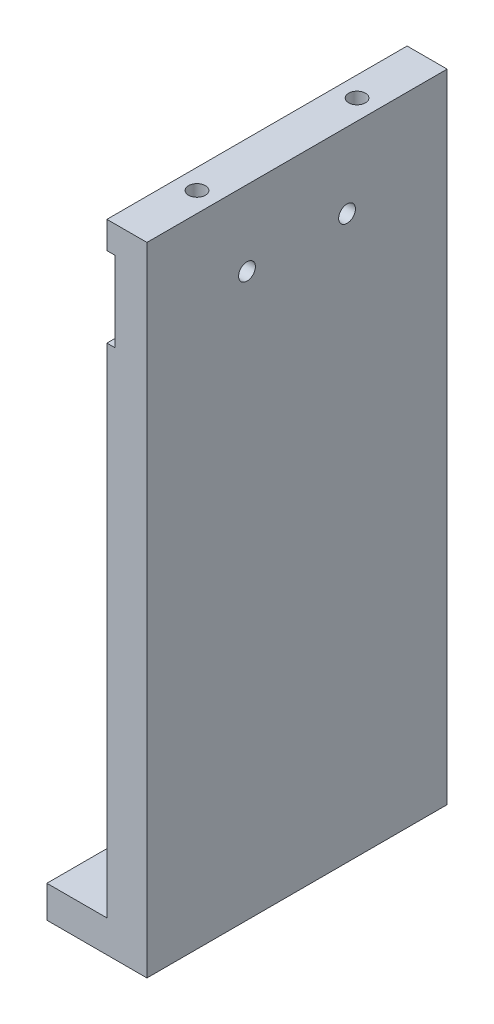
ISO-10303-21;
HEADER;
FILE_DESCRIPTION(('STEP AP214'),'2;1');
FILE_NAME('part.step','',(''),(''),'','','');
FILE_SCHEMA(('AUTOMOTIVE_DESIGN { 1 0 10303 214 1 1 1 1 }'));
ENDSEC;
DATA;
#1=APPLICATION_CONTEXT('core data for automotive mechanical design processes');
#2=APPLICATION_PROTOCOL_DEFINITION('international standard','automotive_design',2000,#1);
#3=PRODUCT_CONTEXT('',#1,'mechanical');
#4=PRODUCT('Part','Part','',(#3));
#5=PRODUCT_RELATED_PRODUCT_CATEGORY('part','',(#4));
#6=PRODUCT_DEFINITION_FORMATION('','',#4);
#7=PRODUCT_DEFINITION_CONTEXT('part definition',#1,'design');
#8=PRODUCT_DEFINITION('design','',#6,#7);
#9=PRODUCT_DEFINITION_SHAPE('','',#8);
#10=(LENGTH_UNIT() NAMED_UNIT(*) SI_UNIT(.MILLI.,.METRE.));
#11=(NAMED_UNIT(*) PLANE_ANGLE_UNIT() SI_UNIT($,.RADIAN.));
#12=(NAMED_UNIT(*) SI_UNIT($,.STERADIAN.) SOLID_ANGLE_UNIT());
#13=UNCERTAINTY_MEASURE_WITH_UNIT(LENGTH_MEASURE(1.E-05),#10,'distance_accuracy_value','');
#14=(GEOMETRIC_REPRESENTATION_CONTEXT(3) GLOBAL_UNCERTAINTY_ASSIGNED_CONTEXT((#13)) GLOBAL_UNIT_ASSIGNED_CONTEXT((#10,
#11,#12)) REPRESENTATION_CONTEXT('',''));
#15=CARTESIAN_POINT('',(0.,0.,0.));
#16=DIRECTION('',(0.,0.,1.));
#17=DIRECTION('',(1.,0.,0.));
#18=AXIS2_PLACEMENT_3D('',#15,#16,#17);
#19=CARTESIAN_POINT('',(0.,0.,75.));
#20=DIRECTION('',(1.,0.,0.));
#21=DIRECTION('',(0.,1.,0.));
#22=AXIS2_PLACEMENT_3D('',#19,#20,#21);
#23=PLANE('',#22);
#24=DIRECTION('',(0.,0.,-1.));
#25=VECTOR('',#24,1.);
#26=CARTESIAN_POINT('',(0.,8.,0.));
#27=LINE('',#26,#25);
#28=CARTESIAN_POINT('',(0.,8.,75.));
#29=VERTEX_POINT('',#28);
#30=CARTESIAN_POINT('',(0.,8.,0.));
#31=VERTEX_POINT('',#30);
#32=EDGE_CURVE('E53',#29,#31,#27,.T.);
#33=ORIENTED_EDGE('',*,*,#32,.F.);
#34=DIRECTION('',(0.,-1.,0.));
#35=VECTOR('',#34,1.);
#36=CARTESIAN_POINT('',(0.,0.,75.));
#37=LINE('',#36,#35);
#38=CARTESIAN_POINT('',(0.,132.38,75.));
#39=VERTEX_POINT('',#38);
#40=EDGE_CURVE('E210',#39,#29,#37,.T.);
#41=ORIENTED_EDGE('',*,*,#40,.F.);
#42=DIRECTION('',(0.,0.,1.));
#43=VECTOR('',#42,1.);
#44=CARTESIAN_POINT('',(0.,132.38,0.));
#45=LINE('',#44,#43);
#46=CARTESIAN_POINT('',(0.,132.38,0.));
#47=VERTEX_POINT('',#46);
#48=EDGE_CURVE('E172',#47,#39,#45,.T.);
#49=ORIENTED_EDGE('',*,*,#48,.F.);
#50=DIRECTION('',(0.,-1.,0.));
#51=VECTOR('',#50,1.);
#52=CARTESIAN_POINT('',(0.,0.,0.));
#53=LINE('',#52,#51);
#54=EDGE_CURVE('E58',#47,#31,#53,.T.);
#55=ORIENTED_EDGE('',*,*,#54,.T.);
#56=EDGE_LOOP('',(#33,#41,#49,#55));
#57=FACE_BOUND('',#56,.T.);
#58=ADVANCED_FACE('F39',(#57),#23,.F.);
#59=CARTESIAN_POINT('',(0.,159.15,0.));
#60=VERTEX_POINT('',#59);
#61=CARTESIAN_POINT('',(0.,152.38,0.));
#62=VERTEX_POINT('',#61);
#63=EDGE_CURVE('E132',#60,#62,#53,.T.);
#64=ORIENTED_EDGE('',*,*,#63,.T.);
#65=DIRECTION('',(0.,0.,-1.));
#66=VECTOR('',#65,1.);
#67=CARTESIAN_POINT('',(0.,152.38,0.));
#68=LINE('',#67,#66);
#69=CARTESIAN_POINT('',(0.,152.38,75.));
#70=VERTEX_POINT('',#69);
#71=EDGE_CURVE('E177',#70,#62,#68,.T.);
#72=ORIENTED_EDGE('',*,*,#71,.F.);
#73=CARTESIAN_POINT('',(0.,159.15,75.));
#74=VERTEX_POINT('',#73);
#75=EDGE_CURVE('E207',#74,#70,#37,.T.);
#76=ORIENTED_EDGE('',*,*,#75,.F.);
#77=DIRECTION('',(0.,0.,-1.));
#78=VECTOR('',#77,1.);
#79=CARTESIAN_POINT('',(0.,159.15,75.));
#80=LINE('',#79,#78);
#81=EDGE_CURVE('E216',#74,#60,#80,.T.);
#82=ORIENTED_EDGE('',*,*,#81,.T.);
#83=EDGE_LOOP('',(#64,#72,#76,#82));
#84=FACE_BOUND('',#83,.T.);
#85=ADVANCED_FACE('F236',(#84),#23,.F.);
#86=CARTESIAN_POINT('',(0.,0.,75.));
#87=DIRECTION('',(0.,1.,0.));
#88=DIRECTION('',(0.,0.,1.));
#89=AXIS2_PLACEMENT_3D('',#86,#87,#88);
#90=PLANE('',#89);
#91=CARTESIAN_POINT('',(-7.5,0.,57.5));
#92=DIRECTION('',(0.,1.,0.));
#93=DIRECTION('',(1.,0.,0.));
#94=AXIS2_PLACEMENT_3D('',#91,#92,#93);
#95=CIRCLE('',#94,3.25);
#96=CARTESIAN_POINT('',(-4.25,0.,57.5));
#97=VERTEX_POINT('',#96);
#98=EDGE_CURVE('E452',#97,#97,#95,.T.);
#99=ORIENTED_EDGE('',*,*,#98,.T.);
#100=EDGE_LOOP('',(#99));
#101=FACE_BOUND('',#100,.T.);
#102=CARTESIAN_POINT('',(-7.5,0.,17.5));
#103=DIRECTION('',(0.,1.,0.));
#104=DIRECTION('',(-1.,0.,0.));
#105=AXIS2_PLACEMENT_3D('',#102,#103,#104);
#106=CIRCLE('',#105,3.25);
#107=CARTESIAN_POINT('',(-10.75,0.,17.5));
#108=VERTEX_POINT('',#107);
#109=EDGE_CURVE('E147',#108,#108,#106,.T.);
#110=ORIENTED_EDGE('',*,*,#109,.T.);
#111=EDGE_LOOP('',(#110));
#112=FACE_BOUND('',#111,.T.);
#113=DIRECTION('',(1.,0.,0.));
#114=VECTOR('',#113,1.);
#115=CARTESIAN_POINT('',(0.,0.,0.));
#116=LINE('',#115,#114);
#117=CARTESIAN_POINT('',(-15.,0.,0.));
#118=VERTEX_POINT('',#117);
#119=CARTESIAN_POINT('',(10.,0.,0.));
#120=VERTEX_POINT('',#119);
#121=EDGE_CURVE('E121',#118,#120,#116,.T.);
#122=ORIENTED_EDGE('',*,*,#121,.T.);
#123=DIRECTION('',(0.,0.,-1.));
#124=VECTOR('',#123,1.);
#125=CARTESIAN_POINT('',(10.,0.,75.));
#126=LINE('',#125,#124);
#127=CARTESIAN_POINT('',(10.,0.,75.));
#128=VERTEX_POINT('',#127);
#129=EDGE_CURVE('E11',#128,#120,#126,.T.);
#130=ORIENTED_EDGE('',*,*,#129,.F.);
#131=DIRECTION('',(1.,0.,0.));
#132=VECTOR('',#131,1.);
#133=CARTESIAN_POINT('',(0.,0.,75.));
#134=LINE('',#133,#132);
#135=CARTESIAN_POINT('',(-15.,0.,75.));
#136=VERTEX_POINT('',#135);
#137=EDGE_CURVE('E137',#136,#128,#134,.T.);
#138=ORIENTED_EDGE('',*,*,#137,.F.);
#139=DIRECTION('',(0.,0.,1.));
#140=VECTOR('',#139,1.);
#141=CARTESIAN_POINT('',(-15.,0.,0.));
#142=LINE('',#141,#140);
#143=EDGE_CURVE('E135',#118,#136,#142,.T.);
#144=ORIENTED_EDGE('',*,*,#143,.F.);
#145=EDGE_LOOP('',(#122,#130,#138,#144));
#146=FACE_BOUND('',#145,.T.);
#147=ADVANCED_FACE('F136',(#101,#112,#146),#90,.F.);
#148=CARTESIAN_POINT('',(10.,0.,75.));
#149=DIRECTION('',(-1.,0.,0.));
#150=DIRECTION('',(0.,-1.,0.));
#151=AXIS2_PLACEMENT_3D('',#148,#149,#150);
#152=PLANE('',#151);
#153=CARTESIAN_POINT('',(9.99999999999997,140.3817,25.));
#154=DIRECTION('',(-1.,0.,0.));
#155=DIRECTION('',(0.,-1.,0.));
#156=AXIS2_PLACEMENT_3D('',#153,#154,#155);
#157=CIRCLE('',#156,2.09999999999999);
#158=CARTESIAN_POINT('',(9.99999999999997,138.2817,25.));
#159=VERTEX_POINT('',#158);
#160=EDGE_CURVE('E163',#159,#159,#157,.T.);
#161=ORIENTED_EDGE('',*,*,#160,.T.);
#162=EDGE_LOOP('',(#161));
#163=FACE_BOUND('',#162,.T.);
#164=CARTESIAN_POINT('',(9.99999999999997,140.3817,50.));
#165=DIRECTION('',(-1.,0.,0.));
#166=DIRECTION('',(0.,-1.,0.));
#167=AXIS2_PLACEMENT_3D('',#164,#165,#166);
#168=CIRCLE('',#167,2.09999999999999);
#169=CARTESIAN_POINT('',(9.99999999999997,138.2817,50.));
#170=VERTEX_POINT('',#169);
#171=EDGE_CURVE('E169',#170,#170,#168,.T.);
#172=ORIENTED_EDGE('',*,*,#171,.T.);
#173=EDGE_LOOP('',(#172));
#174=FACE_BOUND('',#173,.T.);
#175=DIRECTION('',(0.,1.,0.));
#176=VECTOR('',#175,1.);
#177=CARTESIAN_POINT('',(10.,0.,0.));
#178=LINE('',#177,#176);
#179=CARTESIAN_POINT('',(9.99999999999997,159.15,0.));
#180=VERTEX_POINT('',#179);
#181=EDGE_CURVE('E129',#120,#180,#178,.T.);
#182=ORIENTED_EDGE('',*,*,#181,.T.);
#183=DIRECTION('',(0.,0.,-1.));
#184=VECTOR('',#183,1.);
#185=CARTESIAN_POINT('',(9.99999999999997,159.15,75.));
#186=LINE('',#185,#184);
#187=CARTESIAN_POINT('',(9.99999999999997,159.15,75.));
#188=VERTEX_POINT('',#187);
#189=EDGE_CURVE('E46',#188,#180,#186,.T.);
#190=ORIENTED_EDGE('',*,*,#189,.F.);
#191=DIRECTION('',(0.,1.,0.));
#192=VECTOR('',#191,1.);
#193=CARTESIAN_POINT('',(10.,0.,75.));
#194=LINE('',#193,#192);
#195=EDGE_CURVE('E212',#128,#188,#194,.T.);
#196=ORIENTED_EDGE('',*,*,#195,.F.);
#197=ORIENTED_EDGE('',*,*,#129,.T.);
#198=EDGE_LOOP('',(#182,#190,#196,#197));
#199=FACE_BOUND('',#198,.T.);
#200=ADVANCED_FACE('F242',(#163,#174,#199),#152,.F.);
#201=CARTESIAN_POINT('',(0.,159.15,75.));
#202=DIRECTION('',(0.,-1.,0.));
#203=DIRECTION('',(0.,0.,-1.));
#204=AXIS2_PLACEMENT_3D('',#201,#202,#203);
#205=PLANE('',#204);
#206=CARTESIAN_POINT('',(4.99999999999922,159.15,57.4999999999991));
#207=DIRECTION('',(0.,1.,0.));
#208=DIRECTION('',(0.,0.,1.));
#209=AXIS2_PLACEMENT_3D('',#206,#207,#208);
#210=CIRCLE('',#209,2.09999999999999);
#211=CARTESIAN_POINT('',(4.99999999999922,159.15,59.599999999999));
#212=VERTEX_POINT('',#211);
#213=EDGE_CURVE('E189',#212,#212,#210,.T.);
#214=ORIENTED_EDGE('',*,*,#213,.F.);
#215=EDGE_LOOP('',(#214));
#216=FACE_BOUND('',#215,.T.);
#217=CARTESIAN_POINT('',(4.99999999999922,159.15,17.499999999999));
#218=DIRECTION('',(0.,1.,0.));
#219=DIRECTION('',(0.,0.,1.));
#220=AXIS2_PLACEMENT_3D('',#217,#218,#219);
#221=CIRCLE('',#220,2.09999999999999);
#222=CARTESIAN_POINT('',(4.99999999999922,159.15,19.599999999999));
#223=VERTEX_POINT('',#222);
#224=EDGE_CURVE('E201',#223,#223,#221,.T.);
#225=ORIENTED_EDGE('',*,*,#224,.F.);
#226=EDGE_LOOP('',(#225));
#227=FACE_BOUND('',#226,.T.);
#228=DIRECTION('',(-1.,0.,0.));
#229=VECTOR('',#228,1.);
#230=CARTESIAN_POINT('',(0.,159.15,0.));
#231=LINE('',#230,#229);
#232=EDGE_CURVE('E220',#180,#60,#231,.T.);
#233=ORIENTED_EDGE('',*,*,#232,.T.);
#234=ORIENTED_EDGE('',*,*,#81,.F.);
#235=DIRECTION('',(-1.,0.,0.));
#236=VECTOR('',#235,1.);
#237=CARTESIAN_POINT('',(0.,159.15,75.));
#238=LINE('',#237,#236);
#239=EDGE_CURVE('E214',#188,#74,#238,.T.);
#240=ORIENTED_EDGE('',*,*,#239,.F.);
#241=ORIENTED_EDGE('',*,*,#189,.T.);
#242=EDGE_LOOP('',(#233,#234,#240,#241));
#243=FACE_BOUND('',#242,.T.);
#244=ADVANCED_FACE('F227',(#216,#227,#243),#205,.F.);
#245=CARTESIAN_POINT('',(0.,0.,75.));
#246=DIRECTION('',(0.,0.,-1.));
#247=DIRECTION('',(-1.,0.,0.));
#248=AXIS2_PLACEMENT_3D('',#245,#246,#247);
#249=PLANE('',#248);
#250=ORIENTED_EDGE('',*,*,#75,.T.);
#251=DIRECTION('',(-1.,0.,0.));
#252=VECTOR('',#251,1.);
#253=CARTESIAN_POINT('',(1.99999999999997,152.38,75.));
#254=LINE('',#253,#252);
#255=CARTESIAN_POINT('',(1.99999999999997,152.38,75.));
#256=VERTEX_POINT('',#255);
#257=EDGE_CURVE('E190',#256,#70,#254,.T.);
#258=ORIENTED_EDGE('',*,*,#257,.F.);
#259=DIRECTION('',(0.,1.,0.));
#260=VECTOR('',#259,1.);
#261=CARTESIAN_POINT('',(1.99999999999997,152.38,75.));
#262=LINE('',#261,#260);
#263=CARTESIAN_POINT('',(1.99999999999998,132.38,75.));
#264=VERTEX_POINT('',#263);
#265=EDGE_CURVE('E180',#264,#256,#262,.T.);
#266=ORIENTED_EDGE('',*,*,#265,.F.);
#267=DIRECTION('',(-1.,0.,0.));
#268=VECTOR('',#267,1.);
#269=CARTESIAN_POINT('',(1.99999999999998,132.38,75.));
#270=LINE('',#269,#268);
#271=EDGE_CURVE('E192',#264,#39,#270,.T.);
#272=ORIENTED_EDGE('',*,*,#271,.T.);
#273=ORIENTED_EDGE('',*,*,#40,.T.);
#274=DIRECTION('',(1.,0.,0.));
#275=VECTOR('',#274,1.);
#276=CARTESIAN_POINT('',(-15.,8.,75.));
#277=LINE('',#276,#275);
#278=CARTESIAN_POINT('',(-15.,8.,75.));
#279=VERTEX_POINT('',#278);
#280=EDGE_CURVE('E157',#279,#29,#277,.T.);
#281=ORIENTED_EDGE('',*,*,#280,.F.);
#282=DIRECTION('',(0.,1.,0.));
#283=VECTOR('',#282,1.);
#284=CARTESIAN_POINT('',(-15.,0.,75.));
#285=LINE('',#284,#283);
#286=EDGE_CURVE('E140',#136,#279,#285,.T.);
#287=ORIENTED_EDGE('',*,*,#286,.F.);
#288=ORIENTED_EDGE('',*,*,#137,.T.);
#289=ORIENTED_EDGE('',*,*,#195,.T.);
#290=ORIENTED_EDGE('',*,*,#239,.T.);
#291=EDGE_LOOP('',(#250,#258,#266,#272,#273,#281,#287,#288,#289,#290));
#292=FACE_BOUND('',#291,.T.);
#293=ADVANCED_FACE('F240',(#292),#249,.F.);
#294=CARTESIAN_POINT('',(0.,0.,0.));
#295=DIRECTION('',(0.,0.,-1.));
#296=DIRECTION('',(-1.,0.,0.));
#297=AXIS2_PLACEMENT_3D('',#294,#295,#296);
#298=PLANE('',#297);
#299=DIRECTION('',(-1.,0.,0.));
#300=VECTOR('',#299,1.);
#301=CARTESIAN_POINT('',(1.99999999999997,152.38,0.));
#302=LINE('',#301,#300);
#303=CARTESIAN_POINT('',(1.99999999999997,152.38,0.));
#304=VERTEX_POINT('',#303);
#305=EDGE_CURVE('E187',#304,#62,#302,.T.);
#306=ORIENTED_EDGE('',*,*,#305,.T.);
#307=ORIENTED_EDGE('',*,*,#63,.F.);
#308=ORIENTED_EDGE('',*,*,#232,.F.);
#309=ORIENTED_EDGE('',*,*,#181,.F.);
#310=ORIENTED_EDGE('',*,*,#121,.F.);
#311=DIRECTION('',(0.,-1.,0.));
#312=VECTOR('',#311,1.);
#313=CARTESIAN_POINT('',(-15.,0.,0.));
#314=LINE('',#313,#312);
#315=CARTESIAN_POINT('',(-15.,8.,0.));
#316=VERTEX_POINT('',#315);
#317=EDGE_CURVE('E127',#316,#118,#314,.T.);
#318=ORIENTED_EDGE('',*,*,#317,.F.);
#319=DIRECTION('',(1.,0.,0.));
#320=VECTOR('',#319,1.);
#321=CARTESIAN_POINT('',(-15.,8.,0.));
#322=LINE('',#321,#320);
#323=EDGE_CURVE('E154',#316,#31,#322,.T.);
#324=ORIENTED_EDGE('',*,*,#323,.T.);
#325=ORIENTED_EDGE('',*,*,#54,.F.);
#326=DIRECTION('',(-1.,0.,0.));
#327=VECTOR('',#326,1.);
#328=CARTESIAN_POINT('',(1.99999999999998,132.38,0.));
#329=LINE('',#328,#327);
#330=CARTESIAN_POINT('',(1.99999999999998,132.38,0.));
#331=VERTEX_POINT('',#330);
#332=EDGE_CURVE('E184',#331,#47,#329,.T.);
#333=ORIENTED_EDGE('',*,*,#332,.F.);
#334=DIRECTION('',(0.,-1.,0.));
#335=VECTOR('',#334,1.);
#336=CARTESIAN_POINT('',(1.99999999999997,152.38,0.));
#337=LINE('',#336,#335);
#338=EDGE_CURVE('E173',#304,#331,#337,.T.);
#339=ORIENTED_EDGE('',*,*,#338,.F.);
#340=EDGE_LOOP('',(#306,#307,#308,#309,#310,#318,#324,#325,#333,#339));
#341=FACE_BOUND('',#340,.T.);
#342=ADVANCED_FACE('F124',(#341),#298,.T.);
#343=CARTESIAN_POINT('',(4.99999999999922,146.75,17.499999999999));
#344=DIRECTION('',(0.,1.,0.));
#345=DIRECTION('',(0.,0.,1.));
#346=AXIS2_PLACEMENT_3D('',#343,#344,#345);
#347=CONICAL_SURFACE('',#346,2.09999999999999,1.02974425867665);
#348=CARTESIAN_POINT('',(4.99999999999922,145.488192700042,17.499999999999));
#349=VERTEX_POINT('',#348);
#350=VERTEX_LOOP('',#349);
#351=FACE_BOUND('',#350,.T.);
#352=CARTESIAN_POINT('',(4.99999999999922,146.75,17.499999999999));
#353=DIRECTION('',(0.,1.,0.));
#354=DIRECTION('',(0.,0.,1.));
#355=AXIS2_PLACEMENT_3D('',#352,#353,#354);
#356=CIRCLE('',#355,2.09999999999999);
#357=CARTESIAN_POINT('',(4.99999999999922,146.75,19.599999999999));
#358=VERTEX_POINT('',#357);
#359=EDGE_CURVE('E204',#358,#358,#356,.T.);
#360=ORIENTED_EDGE('',*,*,#359,.T.);
#361=EDGE_LOOP('',(#360));
#362=FACE_BOUND('',#361,.T.);
#363=ADVANCED_FACE('F338',(#351,#362),#347,.F.);
#364=CARTESIAN_POINT('',(4.99999999999922,159.15,17.499999999999));
#365=DIRECTION('',(0.,1.,0.));
#366=DIRECTION('',(0.,0.,1.));
#367=AXIS2_PLACEMENT_3D('',#364,#365,#366);
#368=CYLINDRICAL_SURFACE('',#367,2.09999999999999);
#369=ORIENTED_EDGE('',*,*,#359,.F.);
#370=EDGE_LOOP('',(#369));
#371=FACE_BOUND('',#370,.T.);
#372=ORIENTED_EDGE('',*,*,#224,.T.);
#373=EDGE_LOOP('',(#372));
#374=FACE_BOUND('',#373,.T.);
#375=ADVANCED_FACE('F385',(#371,#374),#368,.F.);
#376=CARTESIAN_POINT('',(4.99999999999922,146.75,57.4999999999991));
#377=DIRECTION('',(0.,1.,0.));
#378=DIRECTION('',(0.,0.,1.));
#379=AXIS2_PLACEMENT_3D('',#376,#377,#378);
#380=CONICAL_SURFACE('',#379,2.09999999999999,1.02974425867665);
#381=CARTESIAN_POINT('',(4.99999999999922,145.488192700042,57.4999999999991));
#382=VERTEX_POINT('',#381);
#383=VERTEX_LOOP('',#382);
#384=FACE_BOUND('',#383,.T.);
#385=CARTESIAN_POINT('',(4.99999999999922,146.75,57.4999999999991));
#386=DIRECTION('',(0.,1.,0.));
#387=DIRECTION('',(0.,0.,1.));
#388=AXIS2_PLACEMENT_3D('',#385,#386,#387);
#389=CIRCLE('',#388,2.09999999999999);
#390=CARTESIAN_POINT('',(4.99999999999922,146.75,59.599999999999));
#391=VERTEX_POINT('',#390);
#392=EDGE_CURVE('E198',#391,#391,#389,.T.);
#393=ORIENTED_EDGE('',*,*,#392,.T.);
#394=EDGE_LOOP('',(#393));
#395=FACE_BOUND('',#394,.T.);
#396=ADVANCED_FACE('F381',(#384,#395),#380,.F.);
#397=CARTESIAN_POINT('',(4.99999999999922,159.15,57.4999999999991));
#398=DIRECTION('',(0.,1.,0.));
#399=DIRECTION('',(0.,0.,1.));
#400=AXIS2_PLACEMENT_3D('',#397,#398,#399);
#401=CYLINDRICAL_SURFACE('',#400,2.09999999999999);
#402=ORIENTED_EDGE('',*,*,#392,.F.);
#403=EDGE_LOOP('',(#402));
#404=FACE_BOUND('',#403,.T.);
#405=ORIENTED_EDGE('',*,*,#213,.T.);
#406=EDGE_LOOP('',(#405));
#407=FACE_BOUND('',#406,.T.);
#408=ADVANCED_FACE('F271',(#404,#407),#401,.F.);
#409=CARTESIAN_POINT('',(1.99999999999997,152.38,0.));
#410=DIRECTION('',(0.,1.,0.));
#411=DIRECTION('',(-1.,0.,0.));
#412=AXIS2_PLACEMENT_3D('',#409,#410,#411);
#413=PLANE('',#412);
#414=ORIENTED_EDGE('',*,*,#71,.T.);
#415=ORIENTED_EDGE('',*,*,#305,.F.);
#416=DIRECTION('',(0.,0.,-1.));
#417=VECTOR('',#416,1.);
#418=CARTESIAN_POINT('',(1.99999999999997,152.38,0.));
#419=LINE('',#418,#417);
#420=EDGE_CURVE('E182',#256,#304,#419,.T.);
#421=ORIENTED_EDGE('',*,*,#420,.F.);
#422=ORIENTED_EDGE('',*,*,#257,.T.);
#423=EDGE_LOOP('',(#414,#415,#421,#422));
#424=FACE_BOUND('',#423,.T.);
#425=ADVANCED_FACE('F275',(#424),#413,.F.);
#426=CARTESIAN_POINT('',(1.99999999999998,132.38,0.));
#427=DIRECTION('',(0.,-1.,0.));
#428=DIRECTION('',(1.,0.,0.));
#429=AXIS2_PLACEMENT_3D('',#426,#427,#428);
#430=PLANE('',#429);
#431=ORIENTED_EDGE('',*,*,#48,.T.);
#432=ORIENTED_EDGE('',*,*,#271,.F.);
#433=DIRECTION('',(0.,0.,1.));
#434=VECTOR('',#433,1.);
#435=CARTESIAN_POINT('',(1.99999999999998,132.38,0.));
#436=LINE('',#435,#434);
#437=EDGE_CURVE('E176',#331,#264,#436,.T.);
#438=ORIENTED_EDGE('',*,*,#437,.F.);
#439=ORIENTED_EDGE('',*,*,#332,.T.);
#440=EDGE_LOOP('',(#431,#432,#438,#439));
#441=FACE_BOUND('',#440,.T.);
#442=ADVANCED_FACE('F278',(#441),#430,.F.);
#443=CARTESIAN_POINT('',(2.,0.,0.));
#444=DIRECTION('',(-1.,0.,0.));
#445=DIRECTION('',(0.,-1.,0.));
#446=AXIS2_PLACEMENT_3D('',#443,#444,#445);
#447=PLANE('',#446);
#448=CARTESIAN_POINT('',(1.99999999999997,140.3817,25.));
#449=DIRECTION('',(-1.,0.,0.));
#450=DIRECTION('',(0.,0.,1.));
#451=AXIS2_PLACEMENT_3D('',#448,#449,#450);
#452=CIRCLE('',#451,2.09999999999999);
#453=CARTESIAN_POINT('',(1.99999999999997,140.3817,27.1));
#454=VERTEX_POINT('',#453);
#455=EDGE_CURVE('E160',#454,#454,#452,.T.);
#456=ORIENTED_EDGE('',*,*,#455,.F.);
#457=EDGE_LOOP('',(#456));
#458=FACE_BOUND('',#457,.T.);
#459=CARTESIAN_POINT('',(1.99999999999997,140.3817,50.));
#460=DIRECTION('',(-1.,0.,0.));
#461=DIRECTION('',(0.,0.,1.));
#462=AXIS2_PLACEMENT_3D('',#459,#460,#461);
#463=CIRCLE('',#462,2.09999999999999);
#464=CARTESIAN_POINT('',(1.99999999999997,140.3817,52.1));
#465=VERTEX_POINT('',#464);
#466=EDGE_CURVE('E166',#465,#465,#463,.T.);
#467=ORIENTED_EDGE('',*,*,#466,.F.);
#468=EDGE_LOOP('',(#467));
#469=FACE_BOUND('',#468,.T.);
#470=ORIENTED_EDGE('',*,*,#338,.T.);
#471=ORIENTED_EDGE('',*,*,#437,.T.);
#472=ORIENTED_EDGE('',*,*,#265,.T.);
#473=ORIENTED_EDGE('',*,*,#420,.T.);
#474=EDGE_LOOP('',(#470,#471,#472,#473));
#475=FACE_BOUND('',#474,.T.);
#476=ADVANCED_FACE('F287',(#458,#469,#475),#447,.T.);
#477=CARTESIAN_POINT('',(1.99999999999997,140.3817,50.));
#478=DIRECTION('',(-1.,0.,0.));
#479=DIRECTION('',(0.,0.,1.));
#480=AXIS2_PLACEMENT_3D('',#477,#478,#479);
#481=CYLINDRICAL_SURFACE('',#480,2.09999999999999);
#482=ORIENTED_EDGE('',*,*,#466,.T.);
#483=EDGE_LOOP('',(#482));
#484=FACE_BOUND('',#483,.T.);
#485=ORIENTED_EDGE('',*,*,#171,.F.);
#486=EDGE_LOOP('',(#485));
#487=FACE_BOUND('',#486,.T.);
#488=ADVANCED_FACE('F297',(#484,#487),#481,.F.);
#489=CARTESIAN_POINT('',(1.99999999999997,140.3817,25.));
#490=DIRECTION('',(-1.,0.,0.));
#491=DIRECTION('',(0.,0.,1.));
#492=AXIS2_PLACEMENT_3D('',#489,#490,#491);
#493=CYLINDRICAL_SURFACE('',#492,2.09999999999999);
#494=ORIENTED_EDGE('',*,*,#455,.T.);
#495=EDGE_LOOP('',(#494));
#496=FACE_BOUND('',#495,.T.);
#497=ORIENTED_EDGE('',*,*,#160,.F.);
#498=EDGE_LOOP('',(#497));
#499=FACE_BOUND('',#498,.T.);
#500=ADVANCED_FACE('F305',(#496,#499),#493,.F.);
#501=CARTESIAN_POINT('',(-15.,8.,0.));
#502=DIRECTION('',(0.,-1.,0.));
#503=DIRECTION('',(1.,0.,0.));
#504=AXIS2_PLACEMENT_3D('',#501,#502,#503);
#505=PLANE('',#504);
#506=CARTESIAN_POINT('',(-7.5,8.,57.5));
#507=DIRECTION('',(0.,1.,0.));
#508=DIRECTION('',(1.,0.,0.));
#509=AXIS2_PLACEMENT_3D('',#506,#507,#508);
#510=CIRCLE('',#509,3.25);
#511=CARTESIAN_POINT('',(-4.25,8.,57.5));
#512=VERTEX_POINT('',#511);
#513=EDGE_CURVE('E455',#512,#512,#510,.T.);
#514=ORIENTED_EDGE('',*,*,#513,.F.);
#515=EDGE_LOOP('',(#514));
#516=FACE_BOUND('',#515,.T.);
#517=CARTESIAN_POINT('',(-7.5,8.,17.5));
#518=DIRECTION('',(0.,1.,0.));
#519=DIRECTION('',(-1.,0.,0.));
#520=AXIS2_PLACEMENT_3D('',#517,#518,#519);
#521=CIRCLE('',#520,3.25);
#522=CARTESIAN_POINT('',(-10.75,8.,17.5));
#523=VERTEX_POINT('',#522);
#524=EDGE_CURVE('E150',#523,#523,#521,.T.);
#525=ORIENTED_EDGE('',*,*,#524,.F.);
#526=EDGE_LOOP('',(#525));
#527=FACE_BOUND('',#526,.T.);
#528=ORIENTED_EDGE('',*,*,#32,.T.);
#529=ORIENTED_EDGE('',*,*,#323,.F.);
#530=DIRECTION('',(0.,0.,-1.));
#531=VECTOR('',#530,1.);
#532=CARTESIAN_POINT('',(-15.,8.,0.));
#533=LINE('',#532,#531);
#534=EDGE_CURVE('E144',#279,#316,#533,.T.);
#535=ORIENTED_EDGE('',*,*,#534,.F.);
#536=ORIENTED_EDGE('',*,*,#280,.T.);
#537=EDGE_LOOP('',(#528,#529,#535,#536));
#538=FACE_BOUND('',#537,.T.);
#539=ADVANCED_FACE('F312',(#516,#527,#538),#505,.F.);
#540=CARTESIAN_POINT('',(-15.,0.,0.));
#541=DIRECTION('',(1.,0.,0.));
#542=DIRECTION('',(0.,1.,0.));
#543=AXIS2_PLACEMENT_3D('',#540,#541,#542);
#544=PLANE('',#543);
#545=ORIENTED_EDGE('',*,*,#317,.T.);
#546=ORIENTED_EDGE('',*,*,#143,.T.);
#547=ORIENTED_EDGE('',*,*,#286,.T.);
#548=ORIENTED_EDGE('',*,*,#534,.T.);
#549=EDGE_LOOP('',(#545,#546,#547,#548));
#550=FACE_BOUND('',#549,.T.);
#551=ADVANCED_FACE('F142',(#550),#544,.F.);
#552=CARTESIAN_POINT('',(-7.5,0.,17.5));
#553=DIRECTION('',(0.,1.,0.));
#554=DIRECTION('',(-1.,0.,0.));
#555=AXIS2_PLACEMENT_3D('',#552,#553,#554);
#556=CYLINDRICAL_SURFACE('',#555,3.25);
#557=ORIENTED_EDGE('',*,*,#109,.F.);
#558=EDGE_LOOP('',(#557));
#559=FACE_BOUND('',#558,.T.);
#560=ORIENTED_EDGE('',*,*,#524,.T.);
#561=EDGE_LOOP('',(#560));
#562=FACE_BOUND('',#561,.T.);
#563=ADVANCED_FACE('F354',(#559,#562),#556,.F.);
#564=CARTESIAN_POINT('',(-7.5,0.,57.5));
#565=DIRECTION('',(0.,1.,0.));
#566=DIRECTION('',(-1.,0.,0.));
#567=AXIS2_PLACEMENT_3D('',#564,#565,#566);
#568=CYLINDRICAL_SURFACE('',#567,3.25);
#569=ORIENTED_EDGE('',*,*,#98,.F.);
#570=EDGE_LOOP('',(#569));
#571=FACE_BOUND('',#570,.T.);
#572=ORIENTED_EDGE('',*,*,#513,.T.);
#573=EDGE_LOOP('',(#572));
#574=FACE_BOUND('',#573,.T.);
#575=ADVANCED_FACE('F359',(#571,#574),#568,.F.);
#576=CLOSED_SHELL('',(#58,#85,#147,#200,#244,#293,#342,#363,#375,#396,#408,#425,#442,#476,#488,
#500,#539,#551,#563,#575));
#577=MANIFOLD_SOLID_BREP('B2',#576);
#578=ADVANCED_BREP_SHAPE_REPRESENTATION('',(#18,#577),#14);
#579=SHAPE_DEFINITION_REPRESENTATION(#9,#578);
ENDSEC;
END-ISO-10303-21;
